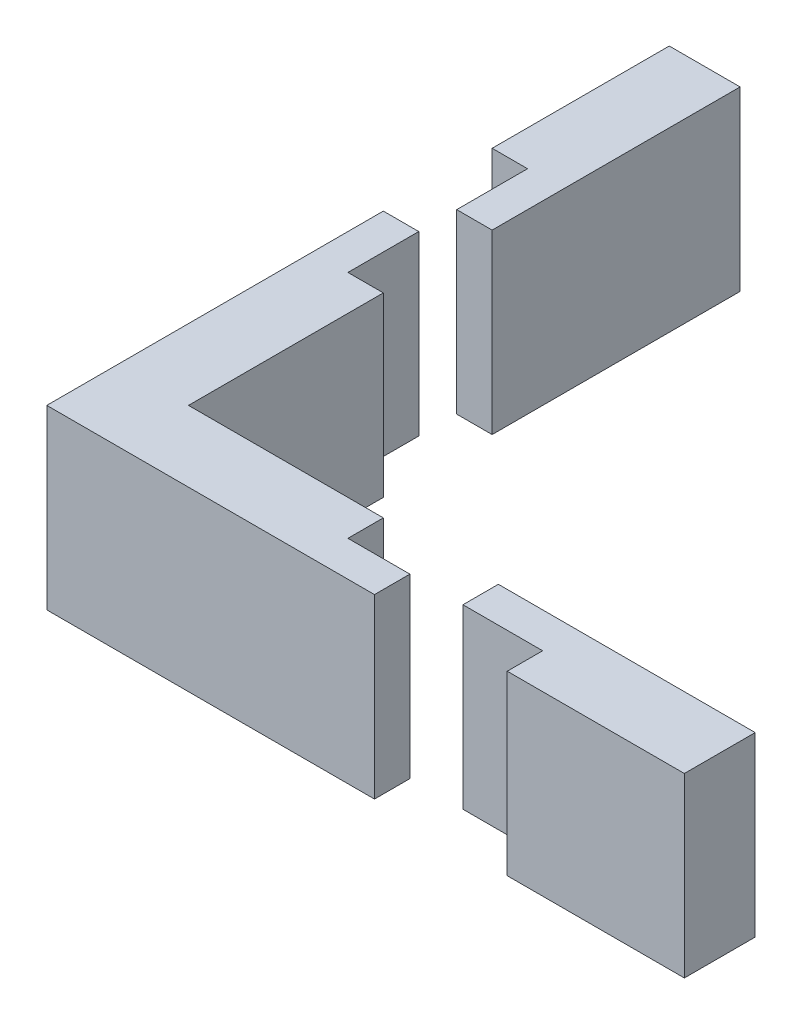
ISO-10303-21;
HEADER;
FILE_DESCRIPTION(('STEP AP214'),'2;1');
FILE_NAME('part.step','',(''),(''),'','','');
FILE_SCHEMA(('AUTOMOTIVE_DESIGN { 1 0 10303 214 1 1 1 1 }'));
ENDSEC;
DATA;
#1=APPLICATION_CONTEXT('core data for automotive mechanical design processes');
#2=APPLICATION_PROTOCOL_DEFINITION('international standard','automotive_design',2000,#1);
#3=PRODUCT_CONTEXT('',#1,'mechanical');
#4=PRODUCT('Part','Part','',(#3));
#5=PRODUCT_RELATED_PRODUCT_CATEGORY('part','',(#4));
#6=PRODUCT_DEFINITION_FORMATION('','',#4);
#7=PRODUCT_DEFINITION_CONTEXT('part definition',#1,'design');
#8=PRODUCT_DEFINITION('design','',#6,#7);
#9=PRODUCT_DEFINITION_SHAPE('','',#8);
#10=(LENGTH_UNIT() NAMED_UNIT(*) SI_UNIT(.MILLI.,.METRE.));
#11=(NAMED_UNIT(*) PLANE_ANGLE_UNIT() SI_UNIT($,.RADIAN.));
#12=(NAMED_UNIT(*) SI_UNIT($,.STERADIAN.) SOLID_ANGLE_UNIT());
#13=UNCERTAINTY_MEASURE_WITH_UNIT(LENGTH_MEASURE(1.E-05),#10,'distance_accuracy_value','');
#14=(GEOMETRIC_REPRESENTATION_CONTEXT(3) GLOBAL_UNCERTAINTY_ASSIGNED_CONTEXT((#13)) GLOBAL_UNIT_ASSIGNED_CONTEXT((#10,
#11,#12)) REPRESENTATION_CONTEXT('',''));
#15=CARTESIAN_POINT('',(0.,0.,0.));
#16=DIRECTION('',(0.,0.,1.));
#17=DIRECTION('',(1.,0.,0.));
#18=AXIS2_PLACEMENT_3D('',#15,#16,#17);
#19=CARTESIAN_POINT('',(0.,10.,5.5));
#20=DIRECTION('',(0.,0.,-1.));
#21=DIRECTION('',(-1.,0.,0.));
#22=AXIS2_PLACEMENT_3D('',#19,#20,#21);
#23=PLANE('',#22);
#24=DIRECTION('',(1.,0.,0.));
#25=VECTOR('',#24,1.);
#26=CARTESIAN_POINT('',(0.,0.,5.5));
#27=LINE('',#26,#25);
#28=CARTESIAN_POINT('',(19.4948605152185,0.,5.5));
#29=VERTEX_POINT('',#28);
#30=CARTESIAN_POINT('',(23.9948605152185,0.,5.5));
#31=VERTEX_POINT('',#30);
#32=EDGE_CURVE('E132',#29,#31,#27,.T.);
#33=ORIENTED_EDGE('',*,*,#32,.T.);
#34=DIRECTION('',(0.,-1.,0.));
#35=VECTOR('',#34,1.);
#36=CARTESIAN_POINT('',(23.9948605152185,10.,5.5));
#37=LINE('',#36,#35);
#38=CARTESIAN_POINT('',(23.9948605152185,10.,5.5));
#39=VERTEX_POINT('',#38);
#40=EDGE_CURVE('E12',#39,#31,#37,.T.);
#41=ORIENTED_EDGE('',*,*,#40,.F.);
#42=DIRECTION('',(1.,0.,0.));
#43=VECTOR('',#42,1.);
#44=CARTESIAN_POINT('',(0.,10.,5.5));
#45=LINE('',#44,#43);
#46=CARTESIAN_POINT('',(19.4948605152185,10.,5.5));
#47=VERTEX_POINT('',#46);
#48=EDGE_CURVE('E97',#47,#39,#45,.T.);
#49=ORIENTED_EDGE('',*,*,#48,.F.);
#50=DIRECTION('',(0.,-1.,0.));
#51=VECTOR('',#50,1.);
#52=CARTESIAN_POINT('',(19.4948605152185,10.,5.5));
#53=LINE('',#52,#51);
#54=EDGE_CURVE('E66',#47,#29,#53,.T.);
#55=ORIENTED_EDGE('',*,*,#54,.T.);
#56=EDGE_LOOP('',(#33,#41,#49,#55));
#57=FACE_BOUND('',#56,.T.);
#58=ADVANCED_FACE('F50',(#57),#23,.F.);
#59=CARTESIAN_POINT('',(23.9948605152185,10.,0.));
#60=DIRECTION('',(-1.,0.,0.));
#61=DIRECTION('',(0.,0.,1.));
#62=AXIS2_PLACEMENT_3D('',#59,#60,#61);
#63=PLANE('',#62);
#64=DIRECTION('',(0.,0.,-1.));
#65=VECTOR('',#64,1.);
#66=CARTESIAN_POINT('',(23.9948605152185,0.,0.));
#67=LINE('',#66,#65);
#68=CARTESIAN_POINT('',(23.9948605152185,0.,7.5));
#69=VERTEX_POINT('',#68);
#70=EDGE_CURVE('E134',#69,#31,#67,.T.);
#71=ORIENTED_EDGE('',*,*,#70,.F.);
#72=DIRECTION('',(0.,-1.,0.));
#73=VECTOR('',#72,1.);
#74=CARTESIAN_POINT('',(23.9948605152185,10.,7.5));
#75=LINE('',#74,#73);
#76=CARTESIAN_POINT('',(23.9948605152185,10.,7.5));
#77=VERTEX_POINT('',#76);
#78=EDGE_CURVE('E58',#77,#69,#75,.T.);
#79=ORIENTED_EDGE('',*,*,#78,.F.);
#80=DIRECTION('',(0.,0.,-1.));
#81=VECTOR('',#80,1.);
#82=CARTESIAN_POINT('',(23.9948605152185,10.,0.));
#83=LINE('',#82,#81);
#84=EDGE_CURVE('E157',#77,#39,#83,.T.);
#85=ORIENTED_EDGE('',*,*,#84,.T.);
#86=ORIENTED_EDGE('',*,*,#40,.T.);
#87=EDGE_LOOP('',(#71,#79,#85,#86));
#88=FACE_BOUND('',#87,.T.);
#89=ADVANCED_FACE('F156',(#88),#63,.T.);
#90=CARTESIAN_POINT('',(0.,10.,7.5));
#91=DIRECTION('',(0.,0.,-1.));
#92=DIRECTION('',(-1.,0.,0.));
#93=AXIS2_PLACEMENT_3D('',#90,#91,#92);
#94=PLANE('',#93);
#95=DIRECTION('',(1.,0.,0.));
#96=VECTOR('',#95,1.);
#97=CARTESIAN_POINT('',(0.,0.,7.5));
#98=LINE('',#97,#96);
#99=CARTESIAN_POINT('',(33.9948605152185,0.,7.5));
#100=VERTEX_POINT('',#99);
#101=EDGE_CURVE('E137',#69,#100,#98,.T.);
#102=ORIENTED_EDGE('',*,*,#101,.T.);
#103=DIRECTION('',(0.,-1.,0.));
#104=VECTOR('',#103,1.);
#105=CARTESIAN_POINT('',(33.9948605152185,10.,7.5));
#106=LINE('',#105,#104);
#107=CARTESIAN_POINT('',(33.9948605152185,10.,7.5));
#108=VERTEX_POINT('',#107);
#109=EDGE_CURVE('E117',#108,#100,#106,.T.);
#110=ORIENTED_EDGE('',*,*,#109,.F.);
#111=DIRECTION('',(1.,0.,0.));
#112=VECTOR('',#111,1.);
#113=CARTESIAN_POINT('',(0.,10.,7.5));
#114=LINE('',#113,#112);
#115=EDGE_CURVE('E123',#77,#108,#114,.T.);
#116=ORIENTED_EDGE('',*,*,#115,.F.);
#117=ORIENTED_EDGE('',*,*,#78,.T.);
#118=EDGE_LOOP('',(#102,#110,#116,#117));
#119=FACE_BOUND('',#118,.T.);
#120=ADVANCED_FACE('F150',(#119),#94,.F.);
#121=CARTESIAN_POINT('',(33.9948605152185,10.,0.));
#122=DIRECTION('',(1.,0.,0.));
#123=DIRECTION('',(0.,0.,-1.));
#124=AXIS2_PLACEMENT_3D('',#121,#122,#123);
#125=PLANE('',#124);
#126=DIRECTION('',(0.,0.,1.));
#127=VECTOR('',#126,1.);
#128=CARTESIAN_POINT('',(33.9948605152185,0.,0.));
#129=LINE('',#128,#127);
#130=CARTESIAN_POINT('',(33.9948605152185,0.,3.5));
#131=VERTEX_POINT('',#130);
#132=EDGE_CURVE('E113',#131,#100,#129,.T.);
#133=ORIENTED_EDGE('',*,*,#132,.F.);
#134=DIRECTION('',(0.,-1.,0.));
#135=VECTOR('',#134,1.);
#136=CARTESIAN_POINT('',(33.9948605152185,10.,3.5));
#137=LINE('',#136,#135);
#138=CARTESIAN_POINT('',(33.9948605152185,10.,3.5));
#139=VERTEX_POINT('',#138);
#140=EDGE_CURVE('E108',#139,#131,#137,.T.);
#141=ORIENTED_EDGE('',*,*,#140,.F.);
#142=DIRECTION('',(0.,0.,1.));
#143=VECTOR('',#142,1.);
#144=CARTESIAN_POINT('',(33.9948605152185,10.,0.));
#145=LINE('',#144,#143);
#146=EDGE_CURVE('E111',#139,#108,#145,.T.);
#147=ORIENTED_EDGE('',*,*,#146,.T.);
#148=ORIENTED_EDGE('',*,*,#109,.T.);
#149=EDGE_LOOP('',(#133,#141,#147,#148));
#150=FACE_BOUND('',#149,.T.);
#151=ADVANCED_FACE('F110',(#150),#125,.T.);
#152=CARTESIAN_POINT('',(0.,10.,3.5));
#153=DIRECTION('',(0.,0.,-1.));
#154=DIRECTION('',(-1.,0.,0.));
#155=AXIS2_PLACEMENT_3D('',#152,#153,#154);
#156=PLANE('',#155);
#157=DIRECTION('',(1.,0.,0.));
#158=VECTOR('',#157,1.);
#159=CARTESIAN_POINT('',(0.,0.,3.5));
#160=LINE('',#159,#158);
#161=CARTESIAN_POINT('',(19.4948605152185,0.,3.5));
#162=VERTEX_POINT('',#161);
#163=EDGE_CURVE('E141',#162,#131,#160,.T.);
#164=ORIENTED_EDGE('',*,*,#163,.F.);
#165=DIRECTION('',(0.,-1.,0.));
#166=VECTOR('',#165,1.);
#167=CARTESIAN_POINT('',(19.4948605152185,10.,3.5));
#168=LINE('',#167,#166);
#169=CARTESIAN_POINT('',(19.4948605152185,10.,3.5));
#170=VERTEX_POINT('',#169);
#171=EDGE_CURVE('E85',#170,#162,#168,.T.);
#172=ORIENTED_EDGE('',*,*,#171,.F.);
#173=DIRECTION('',(1.,0.,0.));
#174=VECTOR('',#173,1.);
#175=CARTESIAN_POINT('',(0.,10.,3.5));
#176=LINE('',#175,#174);
#177=EDGE_CURVE('E121',#170,#139,#176,.T.);
#178=ORIENTED_EDGE('',*,*,#177,.T.);
#179=ORIENTED_EDGE('',*,*,#140,.T.);
#180=EDGE_LOOP('',(#164,#172,#178,#179));
#181=FACE_BOUND('',#180,.T.);
#182=ADVANCED_FACE('F126',(#181),#156,.T.);
#183=CARTESIAN_POINT('',(19.4948605152185,10.,0.));
#184=DIRECTION('',(-1.,0.,0.));
#185=DIRECTION('',(0.,0.,1.));
#186=AXIS2_PLACEMENT_3D('',#183,#184,#185);
#187=PLANE('',#186);
#188=DIRECTION('',(0.,0.,-1.));
#189=VECTOR('',#188,1.);
#190=CARTESIAN_POINT('',(19.4948605152185,0.,0.));
#191=LINE('',#190,#189);
#192=EDGE_CURVE('E143',#29,#162,#191,.T.);
#193=ORIENTED_EDGE('',*,*,#192,.F.);
#194=ORIENTED_EDGE('',*,*,#54,.F.);
#195=DIRECTION('',(0.,0.,-1.));
#196=VECTOR('',#195,1.);
#197=CARTESIAN_POINT('',(19.4948605152185,10.,0.));
#198=LINE('',#197,#196);
#199=EDGE_CURVE('E127',#47,#170,#198,.T.);
#200=ORIENTED_EDGE('',*,*,#199,.T.);
#201=ORIENTED_EDGE('',*,*,#171,.T.);
#202=EDGE_LOOP('',(#193,#194,#200,#201));
#203=FACE_BOUND('',#202,.T.);
#204=ADVANCED_FACE('F158',(#203),#187,.T.);
#205=CARTESIAN_POINT('',(0.,10.,0.));
#206=DIRECTION('',(0.,1.,0.));
#207=DIRECTION('',(0.,0.,1.));
#208=AXIS2_PLACEMENT_3D('',#205,#206,#207);
#209=PLANE('',#208);
#210=ORIENTED_EDGE('',*,*,#48,.T.);
#211=ORIENTED_EDGE('',*,*,#84,.F.);
#212=ORIENTED_EDGE('',*,*,#115,.T.);
#213=ORIENTED_EDGE('',*,*,#146,.F.);
#214=ORIENTED_EDGE('',*,*,#177,.F.);
#215=ORIENTED_EDGE('',*,*,#199,.F.);
#216=EDGE_LOOP('',(#210,#211,#212,#213,#214,#215));
#217=FACE_BOUND('',#216,.T.);
#218=ADVANCED_FACE('F120',(#217),#209,.T.);
#219=CARTESIAN_POINT('',(0.,0.,0.));
#220=DIRECTION('',(0.,1.,0.));
#221=DIRECTION('',(0.,0.,1.));
#222=AXIS2_PLACEMENT_3D('',#219,#220,#221);
#223=PLANE('',#222);
#224=ORIENTED_EDGE('',*,*,#32,.F.);
#225=ORIENTED_EDGE('',*,*,#192,.T.);
#226=ORIENTED_EDGE('',*,*,#163,.T.);
#227=ORIENTED_EDGE('',*,*,#132,.T.);
#228=ORIENTED_EDGE('',*,*,#101,.F.);
#229=ORIENTED_EDGE('',*,*,#70,.T.);
#230=EDGE_LOOP('',(#224,#225,#226,#227,#228,#229));
#231=FACE_BOUND('',#230,.T.);
#232=ADVANCED_FACE('F155',(#231),#223,.F.);
#233=CLOSED_SHELL('',(#58,#89,#120,#151,#182,#204,#218,#232));
#234=MANIFOLD_SOLID_BREP('B2',#233);
#235=CARTESIAN_POINT('',(-2.,10.,0.));
#236=DIRECTION('',(-1.,0.,0.));
#237=DIRECTION('',(0.,0.,1.));
#238=AXIS2_PLACEMENT_3D('',#235,#236,#237);
#239=PLANE('',#238);
#240=DIRECTION('',(0.,0.,-1.));
#241=VECTOR('',#240,1.);
#242=CARTESIAN_POINT('',(-2.,0.,0.));
#243=LINE('',#242,#241);
#244=CARTESIAN_POINT('',(-2.,0.,7.5));
#245=VERTEX_POINT('',#244);
#246=CARTESIAN_POINT('',(-2.,0.,-11.5));
#247=VERTEX_POINT('',#246);
#248=EDGE_CURVE('E355',#245,#247,#243,.T.);
#249=ORIENTED_EDGE('',*,*,#248,.F.);
#250=DIRECTION('',(0.,-1.,0.));
#251=VECTOR('',#250,1.);
#252=CARTESIAN_POINT('',(-2.,10.,7.5));
#253=LINE('',#252,#251);
#254=CARTESIAN_POINT('',(-2.,10.,7.5));
#255=VERTEX_POINT('',#254);
#256=EDGE_CURVE('E48',#255,#245,#253,.T.);
#257=ORIENTED_EDGE('',*,*,#256,.F.);
#258=DIRECTION('',(0.,0.,-1.));
#259=VECTOR('',#258,1.);
#260=CARTESIAN_POINT('',(-2.,10.,0.));
#261=LINE('',#260,#259);
#262=CARTESIAN_POINT('',(-2.,10.,-11.5));
#263=VERTEX_POINT('',#262);
#264=EDGE_CURVE('E380',#255,#263,#261,.T.);
#265=ORIENTED_EDGE('',*,*,#264,.T.);
#266=DIRECTION('',(0.,-1.,0.));
#267=VECTOR('',#266,1.);
#268=CARTESIAN_POINT('',(-2.,10.,-11.5));
#269=LINE('',#268,#267);
#270=EDGE_CURVE('E263',#263,#247,#269,.T.);
#271=ORIENTED_EDGE('',*,*,#270,.T.);
#272=EDGE_LOOP('',(#249,#257,#265,#271));
#273=FACE_BOUND('',#272,.T.);
#274=ADVANCED_FACE('F247',(#273),#239,.T.);
#275=CARTESIAN_POINT('',(0.,10.,7.5));
#276=DIRECTION('',(0.,0.,-1.));
#277=DIRECTION('',(-1.,0.,0.));
#278=AXIS2_PLACEMENT_3D('',#275,#276,#277);
#279=PLANE('',#278);
#280=DIRECTION('',(1.,0.,0.));
#281=VECTOR('',#280,1.);
#282=CARTESIAN_POINT('',(0.,0.,7.5));
#283=LINE('',#282,#281);
#284=CARTESIAN_POINT('',(16.5,0.,7.5));
#285=VERTEX_POINT('',#284);
#286=EDGE_CURVE('E357',#245,#285,#283,.T.);
#287=ORIENTED_EDGE('',*,*,#286,.T.);
#288=DIRECTION('',(0.,-1.,0.));
#289=VECTOR('',#288,1.);
#290=CARTESIAN_POINT('',(16.5,10.,7.5));
#291=LINE('',#290,#289);
#292=CARTESIAN_POINT('',(16.5,10.,7.5));
#293=VERTEX_POINT('',#292);
#294=EDGE_CURVE('E255',#293,#285,#291,.T.);
#295=ORIENTED_EDGE('',*,*,#294,.F.);
#296=DIRECTION('',(1.,0.,0.));
#297=VECTOR('',#296,1.);
#298=CARTESIAN_POINT('',(0.,10.,7.5));
#299=LINE('',#298,#297);
#300=EDGE_CURVE('E414',#255,#293,#299,.T.);
#301=ORIENTED_EDGE('',*,*,#300,.F.);
#302=ORIENTED_EDGE('',*,*,#256,.T.);
#303=EDGE_LOOP('',(#287,#295,#301,#302));
#304=FACE_BOUND('',#303,.T.);
#305=ADVANCED_FACE('F436',(#304),#279,.F.);
#306=CARTESIAN_POINT('',(16.5,10.,0.));
#307=DIRECTION('',(-1.,0.,0.));
#308=DIRECTION('',(0.,0.,1.));
#309=AXIS2_PLACEMENT_3D('',#306,#307,#308);
#310=PLANE('',#309);
#311=DIRECTION('',(0.,0.,-1.));
#312=VECTOR('',#311,1.);
#313=CARTESIAN_POINT('',(16.5,0.,0.));
#314=LINE('',#313,#312);
#315=CARTESIAN_POINT('',(16.5,0.,5.5));
#316=VERTEX_POINT('',#315);
#317=EDGE_CURVE('E359',#285,#316,#314,.T.);
#318=ORIENTED_EDGE('',*,*,#317,.T.);
#319=DIRECTION('',(0.,-1.,0.));
#320=VECTOR('',#319,1.);
#321=CARTESIAN_POINT('',(16.5,10.,5.5));
#322=LINE('',#321,#320);
#323=CARTESIAN_POINT('',(16.5,10.,5.5));
#324=VERTEX_POINT('',#323);
#325=EDGE_CURVE('E390',#324,#316,#322,.T.);
#326=ORIENTED_EDGE('',*,*,#325,.F.);
#327=DIRECTION('',(0.,0.,-1.));
#328=VECTOR('',#327,1.);
#329=CARTESIAN_POINT('',(16.5,10.,0.));
#330=LINE('',#329,#328);
#331=EDGE_CURVE('E398',#293,#324,#330,.T.);
#332=ORIENTED_EDGE('',*,*,#331,.F.);
#333=ORIENTED_EDGE('',*,*,#294,.T.);
#334=EDGE_LOOP('',(#318,#326,#332,#333));
#335=FACE_BOUND('',#334,.T.);
#336=ADVANCED_FACE('F396',(#335),#310,.F.);
#337=CARTESIAN_POINT('',(0.,10.,5.5));
#338=DIRECTION('',(0.,0.,-1.));
#339=DIRECTION('',(-1.,0.,0.));
#340=AXIS2_PLACEMENT_3D('',#337,#338,#339);
#341=PLANE('',#340);
#342=DIRECTION('',(1.,0.,0.));
#343=VECTOR('',#342,1.);
#344=CARTESIAN_POINT('',(0.,0.,5.5));
#345=LINE('',#344,#343);
#346=CARTESIAN_POINT('',(13.,0.,5.5));
#347=VERTEX_POINT('',#346);
#348=EDGE_CURVE('E362',#347,#316,#345,.T.);
#349=ORIENTED_EDGE('',*,*,#348,.F.);
#350=DIRECTION('',(0.,-1.,0.));
#351=VECTOR('',#350,1.);
#352=CARTESIAN_POINT('',(13.,10.,5.5));
#353=LINE('',#352,#351);
#354=CARTESIAN_POINT('',(13.,10.,5.5));
#355=VERTEX_POINT('',#354);
#356=EDGE_CURVE('E388',#355,#347,#353,.T.);
#357=ORIENTED_EDGE('',*,*,#356,.F.);
#358=DIRECTION('',(1.,0.,0.));
#359=VECTOR('',#358,1.);
#360=CARTESIAN_POINT('',(0.,10.,5.5));
#361=LINE('',#360,#359);
#362=EDGE_CURVE('E410',#355,#324,#361,.T.);
#363=ORIENTED_EDGE('',*,*,#362,.T.);
#364=ORIENTED_EDGE('',*,*,#325,.T.);
#365=EDGE_LOOP('',(#349,#357,#363,#364));
#366=FACE_BOUND('',#365,.T.);
#367=ADVANCED_FACE('F406',(#366),#341,.T.);
#368=CARTESIAN_POINT('',(13.,10.,0.));
#369=DIRECTION('',(-1.,0.,0.));
#370=DIRECTION('',(0.,0.,1.));
#371=AXIS2_PLACEMENT_3D('',#368,#369,#370);
#372=PLANE('',#371);
#373=DIRECTION('',(0.,0.,-1.));
#374=VECTOR('',#373,1.);
#375=CARTESIAN_POINT('',(13.,0.,0.));
#376=LINE('',#375,#374);
#377=CARTESIAN_POINT('',(13.,0.,3.5));
#378=VERTEX_POINT('',#377);
#379=EDGE_CURVE('E365',#347,#378,#376,.T.);
#380=ORIENTED_EDGE('',*,*,#379,.T.);
#381=DIRECTION('',(0.,-1.,0.));
#382=VECTOR('',#381,1.);
#383=CARTESIAN_POINT('',(13.,10.,3.5));
#384=LINE('',#383,#382);
#385=CARTESIAN_POINT('',(13.,10.,3.5));
#386=VERTEX_POINT('',#385);
#387=EDGE_CURVE('E386',#386,#378,#384,.T.);
#388=ORIENTED_EDGE('',*,*,#387,.F.);
#389=DIRECTION('',(0.,0.,-1.));
#390=VECTOR('',#389,1.);
#391=CARTESIAN_POINT('',(13.,10.,0.));
#392=LINE('',#391,#390);
#393=EDGE_CURVE('E411',#355,#386,#392,.T.);
#394=ORIENTED_EDGE('',*,*,#393,.F.);
#395=ORIENTED_EDGE('',*,*,#356,.T.);
#396=EDGE_LOOP('',(#380,#388,#394,#395));
#397=FACE_BOUND('',#396,.T.);
#398=ADVANCED_FACE('F447',(#397),#372,.F.);
#399=CARTESIAN_POINT('',(0.,10.,3.5));
#400=DIRECTION('',(0.,0.,-1.));
#401=DIRECTION('',(-1.,0.,0.));
#402=AXIS2_PLACEMENT_3D('',#399,#400,#401);
#403=PLANE('',#402);
#404=DIRECTION('',(1.,0.,0.));
#405=VECTOR('',#404,1.);
#406=CARTESIAN_POINT('',(0.,0.,3.5));
#407=LINE('',#406,#405);
#408=CARTESIAN_POINT('',(2.,0.,3.5));
#409=VERTEX_POINT('',#408);
#410=EDGE_CURVE('E368',#409,#378,#407,.T.);
#411=ORIENTED_EDGE('',*,*,#410,.F.);
#412=DIRECTION('',(0.,-1.,0.));
#413=VECTOR('',#412,1.);
#414=CARTESIAN_POINT('',(2.,10.,3.5));
#415=LINE('',#414,#413);
#416=CARTESIAN_POINT('',(2.,10.,3.5));
#417=VERTEX_POINT('',#416);
#418=EDGE_CURVE('E384',#417,#409,#415,.T.);
#419=ORIENTED_EDGE('',*,*,#418,.F.);
#420=DIRECTION('',(1.,0.,0.));
#421=VECTOR('',#420,1.);
#422=CARTESIAN_POINT('',(0.,10.,3.5));
#423=LINE('',#422,#421);
#424=EDGE_CURVE('E350',#417,#386,#423,.T.);
#425=ORIENTED_EDGE('',*,*,#424,.T.);
#426=ORIENTED_EDGE('',*,*,#387,.T.);
#427=EDGE_LOOP('',(#411,#419,#425,#426));
#428=FACE_BOUND('',#427,.T.);
#429=ADVANCED_FACE('F420',(#428),#403,.T.);
#430=CARTESIAN_POINT('',(2.,10.,0.));
#431=DIRECTION('',(1.,0.,0.));
#432=DIRECTION('',(0.,0.,-1.));
#433=AXIS2_PLACEMENT_3D('',#430,#431,#432);
#434=PLANE('',#433);
#435=DIRECTION('',(0.,0.,1.));
#436=VECTOR('',#435,1.);
#437=CARTESIAN_POINT('',(2.,0.,0.));
#438=LINE('',#437,#436);
#439=CARTESIAN_POINT('',(2.,0.,-7.5));
#440=VERTEX_POINT('',#439);
#441=EDGE_CURVE('E371',#440,#409,#438,.T.);
#442=ORIENTED_EDGE('',*,*,#441,.F.);
#443=DIRECTION('',(0.,-1.,0.));
#444=VECTOR('',#443,1.);
#445=CARTESIAN_POINT('',(2.,10.,-7.5));
#446=LINE('',#445,#444);
#447=CARTESIAN_POINT('',(2.,10.,-7.5));
#448=VERTEX_POINT('',#447);
#449=EDGE_CURVE('E335',#448,#440,#446,.T.);
#450=ORIENTED_EDGE('',*,*,#449,.F.);
#451=DIRECTION('',(0.,0.,1.));
#452=VECTOR('',#451,1.);
#453=CARTESIAN_POINT('',(2.,10.,0.));
#454=LINE('',#453,#452);
#455=EDGE_CURVE('E348',#448,#417,#454,.T.);
#456=ORIENTED_EDGE('',*,*,#455,.T.);
#457=ORIENTED_EDGE('',*,*,#418,.T.);
#458=EDGE_LOOP('',(#442,#450,#456,#457));
#459=FACE_BOUND('',#458,.T.);
#460=ADVANCED_FACE('F424',(#459),#434,.T.);
#461=CARTESIAN_POINT('',(0.,10.,-7.5));
#462=DIRECTION('',(0.,0.,-1.));
#463=DIRECTION('',(-1.,0.,0.));
#464=AXIS2_PLACEMENT_3D('',#461,#462,#463);
#465=PLANE('',#464);
#466=DIRECTION('',(1.,0.,0.));
#467=VECTOR('',#466,1.);
#468=CARTESIAN_POINT('',(0.,0.,-7.5));
#469=LINE('',#468,#467);
#470=CARTESIAN_POINT('',(0.,0.,-7.5));
#471=VERTEX_POINT('',#470);
#472=EDGE_CURVE('E332',#471,#440,#469,.T.);
#473=ORIENTED_EDGE('',*,*,#472,.F.);
#474=DIRECTION('',(0.,-1.,0.));
#475=VECTOR('',#474,1.);
#476=CARTESIAN_POINT('',(0.,10.,-7.5));
#477=LINE('',#476,#475);
#478=CARTESIAN_POINT('',(0.,10.,-7.5));
#479=VERTEX_POINT('',#478);
#480=EDGE_CURVE('E326',#479,#471,#477,.T.);
#481=ORIENTED_EDGE('',*,*,#480,.F.);
#482=DIRECTION('',(1.,0.,0.));
#483=VECTOR('',#482,1.);
#484=CARTESIAN_POINT('',(0.,10.,-7.5));
#485=LINE('',#484,#483);
#486=EDGE_CURVE('E330',#479,#448,#485,.T.);
#487=ORIENTED_EDGE('',*,*,#486,.T.);
#488=ORIENTED_EDGE('',*,*,#449,.T.);
#489=EDGE_LOOP('',(#473,#481,#487,#488));
#490=FACE_BOUND('',#489,.T.);
#491=ADVANCED_FACE('F328',(#490),#465,.T.);
#492=CARTESIAN_POINT('',(0.,10.,0.));
#493=DIRECTION('',(-1.,0.,0.));
#494=DIRECTION('',(0.,0.,1.));
#495=AXIS2_PLACEMENT_3D('',#492,#493,#494);
#496=PLANE('',#495);
#497=DIRECTION('',(0.,0.,-1.));
#498=VECTOR('',#497,1.);
#499=CARTESIAN_POINT('',(0.,0.,0.));
#500=LINE('',#499,#498);
#501=CARTESIAN_POINT('',(0.,0.,-11.5));
#502=VERTEX_POINT('',#501);
#503=EDGE_CURVE('E375',#471,#502,#500,.T.);
#504=ORIENTED_EDGE('',*,*,#503,.T.);
#505=DIRECTION('',(0.,-1.,0.));
#506=VECTOR('',#505,1.);
#507=CARTESIAN_POINT('',(0.,10.,-11.5));
#508=LINE('',#507,#506);
#509=CARTESIAN_POINT('',(0.,10.,-11.5));
#510=VERTEX_POINT('',#509);
#511=EDGE_CURVE('E295',#510,#502,#508,.T.);
#512=ORIENTED_EDGE('',*,*,#511,.F.);
#513=DIRECTION('',(0.,0.,-1.));
#514=VECTOR('',#513,1.);
#515=CARTESIAN_POINT('',(0.,10.,0.));
#516=LINE('',#515,#514);
#517=EDGE_CURVE('E337',#479,#510,#516,.T.);
#518=ORIENTED_EDGE('',*,*,#517,.F.);
#519=ORIENTED_EDGE('',*,*,#480,.T.);
#520=EDGE_LOOP('',(#504,#512,#518,#519));
#521=FACE_BOUND('',#520,.T.);
#522=ADVANCED_FACE('F338',(#521),#496,.F.);
#523=CARTESIAN_POINT('',(0.,10.,-11.5));
#524=DIRECTION('',(0.,0.,-1.));
#525=DIRECTION('',(-1.,0.,0.));
#526=AXIS2_PLACEMENT_3D('',#523,#524,#525);
#527=PLANE('',#526);
#528=DIRECTION('',(1.,0.,0.));
#529=VECTOR('',#528,1.);
#530=CARTESIAN_POINT('',(0.,0.,-11.5));
#531=LINE('',#530,#529);
#532=EDGE_CURVE('E377',#247,#502,#531,.T.);
#533=ORIENTED_EDGE('',*,*,#532,.F.);
#534=ORIENTED_EDGE('',*,*,#270,.F.);
#535=DIRECTION('',(1.,0.,0.));
#536=VECTOR('',#535,1.);
#537=CARTESIAN_POINT('',(0.,10.,-11.5));
#538=LINE('',#537,#536);
#539=EDGE_CURVE('E341',#263,#510,#538,.T.);
#540=ORIENTED_EDGE('',*,*,#539,.T.);
#541=ORIENTED_EDGE('',*,*,#511,.T.);
#542=EDGE_LOOP('',(#533,#534,#540,#541));
#543=FACE_BOUND('',#542,.T.);
#544=ADVANCED_FACE('F425',(#543),#527,.T.);
#545=CARTESIAN_POINT('',(0.,10.,0.));
#546=DIRECTION('',(0.,1.,0.));
#547=DIRECTION('',(0.,0.,1.));
#548=AXIS2_PLACEMENT_3D('',#545,#546,#547);
#549=PLANE('',#548);
#550=ORIENTED_EDGE('',*,*,#264,.F.);
#551=ORIENTED_EDGE('',*,*,#300,.T.);
#552=ORIENTED_EDGE('',*,*,#331,.T.);
#553=ORIENTED_EDGE('',*,*,#362,.F.);
#554=ORIENTED_EDGE('',*,*,#393,.T.);
#555=ORIENTED_EDGE('',*,*,#424,.F.);
#556=ORIENTED_EDGE('',*,*,#455,.F.);
#557=ORIENTED_EDGE('',*,*,#486,.F.);
#558=ORIENTED_EDGE('',*,*,#517,.T.);
#559=ORIENTED_EDGE('',*,*,#539,.F.);
#560=EDGE_LOOP('',(#550,#551,#552,#553,#554,#555,#556,#557,#558,#559));
#561=FACE_BOUND('',#560,.T.);
#562=ADVANCED_FACE('F345',(#561),#549,.T.);
#563=CARTESIAN_POINT('',(0.,0.,0.));
#564=DIRECTION('',(0.,1.,0.));
#565=DIRECTION('',(0.,0.,1.));
#566=AXIS2_PLACEMENT_3D('',#563,#564,#565);
#567=PLANE('',#566);
#568=ORIENTED_EDGE('',*,*,#248,.T.);
#569=ORIENTED_EDGE('',*,*,#532,.T.);
#570=ORIENTED_EDGE('',*,*,#503,.F.);
#571=ORIENTED_EDGE('',*,*,#472,.T.);
#572=ORIENTED_EDGE('',*,*,#441,.T.);
#573=ORIENTED_EDGE('',*,*,#410,.T.);
#574=ORIENTED_EDGE('',*,*,#379,.F.);
#575=ORIENTED_EDGE('',*,*,#348,.T.);
#576=ORIENTED_EDGE('',*,*,#317,.F.);
#577=ORIENTED_EDGE('',*,*,#286,.F.);
#578=EDGE_LOOP('',(#568,#569,#570,#571,#572,#573,#574,#575,#576,#577));
#579=FACE_BOUND('',#578,.T.);
#580=ADVANCED_FACE('F402',(#579),#567,.F.);
#581=CLOSED_SHELL('',(#274,#305,#336,#367,#398,#429,#460,#491,#522,#544,#562,#580));
#582=MANIFOLD_SOLID_BREP('B6',#581);
#583=CARTESIAN_POINT('',(-2.,10.,0.));
#584=DIRECTION('',(-1.,0.,0.));
#585=DIRECTION('',(0.,0.,1.));
#586=AXIS2_PLACEMENT_3D('',#583,#584,#585);
#587=PLANE('',#586);
#588=DIRECTION('',(0.,0.,-1.));
#589=VECTOR('',#588,1.);
#590=CARTESIAN_POINT('',(-2.,0.,0.));
#591=LINE('',#590,#589);
#592=CARTESIAN_POINT('',(-2.,0.,-17.6424504485413));
#593=VERTEX_POINT('',#592);
#594=CARTESIAN_POINT('',(-2.,0.,-27.6424504485413));
#595=VERTEX_POINT('',#594);
#596=EDGE_CURVE('E643',#593,#595,#591,.T.);
#597=ORIENTED_EDGE('',*,*,#596,.F.);
#598=DIRECTION('',(0.,-1.,0.));
#599=VECTOR('',#598,1.);
#600=CARTESIAN_POINT('',(-2.,10.,-17.6424504485413));
#601=LINE('',#600,#599);
#602=CARTESIAN_POINT('',(-2.,10.,-17.6424504485413));
#603=VERTEX_POINT('',#602);
#604=EDGE_CURVE('E245',#603,#593,#601,.T.);
#605=ORIENTED_EDGE('',*,*,#604,.F.);
#606=DIRECTION('',(0.,0.,-1.));
#607=VECTOR('',#606,1.);
#608=CARTESIAN_POINT('',(-2.,10.,0.));
#609=LINE('',#608,#607);
#610=CARTESIAN_POINT('',(-2.,10.,-27.6424504485413));
#611=VERTEX_POINT('',#610);
#612=EDGE_CURVE('E656',#603,#611,#609,.T.);
#613=ORIENTED_EDGE('',*,*,#612,.T.);
#614=DIRECTION('',(0.,-1.,0.));
#615=VECTOR('',#614,1.);
#616=CARTESIAN_POINT('',(-2.,10.,-27.6424504485413));
#617=LINE('',#616,#615);
#618=EDGE_CURVE('E608',#611,#595,#617,.T.);
#619=ORIENTED_EDGE('',*,*,#618,.T.);
#620=EDGE_LOOP('',(#597,#605,#613,#619));
#621=FACE_BOUND('',#620,.T.);
#622=ADVANCED_FACE('F563',(#621),#587,.T.);
#623=CARTESIAN_POINT('',(0.,10.,-17.6424504485413));
#624=DIRECTION('',(0.,0.,1.));
#625=DIRECTION('',(1.,0.,0.));
#626=AXIS2_PLACEMENT_3D('',#623,#624,#625);
#627=PLANE('',#626);
#628=DIRECTION('',(-1.,0.,0.));
#629=VECTOR('',#628,1.);
#630=CARTESIAN_POINT('',(0.,0.,-17.6424504485413));
#631=LINE('',#630,#629);
#632=CARTESIAN_POINT('',(0.,0.,-17.6424504485413));
#633=VERTEX_POINT('',#632);
#634=EDGE_CURVE('E646',#633,#593,#631,.T.);
#635=ORIENTED_EDGE('',*,*,#634,.F.);
#636=DIRECTION('',(0.,-1.,0.));
#637=VECTOR('',#636,1.);
#638=CARTESIAN_POINT('',(0.,10.,-17.6424504485413));
#639=LINE('',#638,#637);
#640=CARTESIAN_POINT('',(0.,10.,-17.6424504485413));
#641=VERTEX_POINT('',#640);
#642=EDGE_CURVE('E571',#641,#633,#639,.T.);
#643=ORIENTED_EDGE('',*,*,#642,.F.);
#644=DIRECTION('',(-1.,0.,0.));
#645=VECTOR('',#644,1.);
#646=CARTESIAN_POINT('',(0.,10.,-17.6424504485413));
#647=LINE('',#646,#645);
#648=EDGE_CURVE('E671',#641,#603,#647,.T.);
#649=ORIENTED_EDGE('',*,*,#648,.T.);
#650=ORIENTED_EDGE('',*,*,#604,.T.);
#651=EDGE_LOOP('',(#635,#643,#649,#650));
#652=FACE_BOUND('',#651,.T.);
#653=ADVANCED_FACE('F665',(#652),#627,.T.);
#654=CARTESIAN_POINT('',(0.,10.,0.));
#655=DIRECTION('',(-1.,0.,0.));
#656=DIRECTION('',(0.,0.,1.));
#657=AXIS2_PLACEMENT_3D('',#654,#655,#656);
#658=PLANE('',#657);
#659=DIRECTION('',(0.,0.,-1.));
#660=VECTOR('',#659,1.);
#661=CARTESIAN_POINT('',(0.,0.,0.));
#662=LINE('',#661,#660);
#663=CARTESIAN_POINT('',(0.,0.,-13.6424504485413));
#664=VERTEX_POINT('',#663);
#665=EDGE_CURVE('E649',#664,#633,#662,.T.);
#666=ORIENTED_EDGE('',*,*,#665,.F.);
#667=DIRECTION('',(0.,-1.,0.));
#668=VECTOR('',#667,1.);
#669=CARTESIAN_POINT('',(0.,10.,-13.6424504485413));
#670=LINE('',#669,#668);
#671=CARTESIAN_POINT('',(0.,10.,-13.6424504485413));
#672=VERTEX_POINT('',#671);
#673=EDGE_CURVE('E635',#672,#664,#670,.T.);
#674=ORIENTED_EDGE('',*,*,#673,.F.);
#675=DIRECTION('',(0.,0.,-1.));
#676=VECTOR('',#675,1.);
#677=CARTESIAN_POINT('',(0.,10.,0.));
#678=LINE('',#677,#676);
#679=EDGE_CURVE('E628',#672,#641,#678,.T.);
#680=ORIENTED_EDGE('',*,*,#679,.T.);
#681=ORIENTED_EDGE('',*,*,#642,.T.);
#682=EDGE_LOOP('',(#666,#674,#680,#681));
#683=FACE_BOUND('',#682,.T.);
#684=ADVANCED_FACE('F662',(#683),#658,.T.);
#685=CARTESIAN_POINT('',(0.,10.,-13.6424504485413));
#686=DIRECTION('',(0.,0.,-1.));
#687=DIRECTION('',(-1.,0.,0.));
#688=AXIS2_PLACEMENT_3D('',#685,#686,#687);
#689=PLANE('',#688);
#690=DIRECTION('',(1.,0.,0.));
#691=VECTOR('',#690,1.);
#692=CARTESIAN_POINT('',(0.,0.,-13.6424504485413));
#693=LINE('',#692,#691);
#694=CARTESIAN_POINT('',(2.,0.,-13.6424504485413));
#695=VERTEX_POINT('',#694);
#696=EDGE_CURVE('E634',#664,#695,#693,.T.);
#697=ORIENTED_EDGE('',*,*,#696,.T.);
#698=DIRECTION('',(0.,-1.,0.));
#699=VECTOR('',#698,1.);
#700=CARTESIAN_POINT('',(2.,10.,-13.6424504485413));
#701=LINE('',#700,#699);
#702=CARTESIAN_POINT('',(2.,10.,-13.6424504485413));
#703=VERTEX_POINT('',#702);
#704=EDGE_CURVE('E631',#703,#695,#701,.T.);
#705=ORIENTED_EDGE('',*,*,#704,.F.);
#706=DIRECTION('',(1.,0.,0.));
#707=VECTOR('',#706,1.);
#708=CARTESIAN_POINT('',(0.,10.,-13.6424504485413));
#709=LINE('',#708,#707);
#710=EDGE_CURVE('E621',#672,#703,#709,.T.);
#711=ORIENTED_EDGE('',*,*,#710,.F.);
#712=ORIENTED_EDGE('',*,*,#673,.T.);
#713=EDGE_LOOP('',(#697,#705,#711,#712));
#714=FACE_BOUND('',#713,.T.);
#715=ADVANCED_FACE('F632',(#714),#689,.F.);
#716=CARTESIAN_POINT('',(2.,10.,0.));
#717=DIRECTION('',(-1.,0.,0.));
#718=DIRECTION('',(0.,0.,1.));
#719=AXIS2_PLACEMENT_3D('',#716,#717,#718);
#720=PLANE('',#719);
#721=DIRECTION('',(0.,0.,-1.));
#722=VECTOR('',#721,1.);
#723=CARTESIAN_POINT('',(2.,0.,0.));
#724=LINE('',#723,#722);
#725=CARTESIAN_POINT('',(2.,0.,-27.6424504485413));
#726=VERTEX_POINT('',#725);
#727=EDGE_CURVE('E601',#695,#726,#724,.T.);
#728=ORIENTED_EDGE('',*,*,#727,.T.);
#729=DIRECTION('',(0.,-1.,0.));
#730=VECTOR('',#729,1.);
#731=CARTESIAN_POINT('',(2.,10.,-27.6424504485413));
#732=LINE('',#731,#730);
#733=CARTESIAN_POINT('',(2.,10.,-27.6424504485413));
#734=VERTEX_POINT('',#733);
#735=EDGE_CURVE('E636',#734,#726,#732,.T.);
#736=ORIENTED_EDGE('',*,*,#735,.F.);
#737=DIRECTION('',(0.,0.,-1.));
#738=VECTOR('',#737,1.);
#739=CARTESIAN_POINT('',(2.,10.,0.));
#740=LINE('',#739,#738);
#741=EDGE_CURVE('E625',#703,#734,#740,.T.);
#742=ORIENTED_EDGE('',*,*,#741,.F.);
#743=ORIENTED_EDGE('',*,*,#704,.T.);
#744=EDGE_LOOP('',(#728,#736,#742,#743));
#745=FACE_BOUND('',#744,.T.);
#746=ADVANCED_FACE('F638',(#745),#720,.F.);
#747=CARTESIAN_POINT('',(0.,10.,-27.6424504485413));
#748=DIRECTION('',(0.,0.,1.));
#749=DIRECTION('',(1.,0.,0.));
#750=AXIS2_PLACEMENT_3D('',#747,#748,#749);
#751=PLANE('',#750);
#752=DIRECTION('',(-1.,0.,0.));
#753=VECTOR('',#752,1.);
#754=CARTESIAN_POINT('',(0.,0.,-27.6424504485413));
#755=LINE('',#754,#753);
#756=EDGE_CURVE('E654',#726,#595,#755,.T.);
#757=ORIENTED_EDGE('',*,*,#756,.T.);
#758=ORIENTED_EDGE('',*,*,#618,.F.);
#759=DIRECTION('',(-1.,0.,0.));
#760=VECTOR('',#759,1.);
#761=CARTESIAN_POINT('',(0.,10.,-27.6424504485413));
#762=LINE('',#761,#760);
#763=EDGE_CURVE('E579',#734,#611,#762,.T.);
#764=ORIENTED_EDGE('',*,*,#763,.F.);
#765=ORIENTED_EDGE('',*,*,#735,.T.);
#766=EDGE_LOOP('',(#757,#758,#764,#765));
#767=FACE_BOUND('',#766,.T.);
#768=ADVANCED_FACE('F670',(#767),#751,.F.);
#769=CARTESIAN_POINT('',(0.,10.,0.));
#770=DIRECTION('',(0.,1.,0.));
#771=DIRECTION('',(0.,0.,1.));
#772=AXIS2_PLACEMENT_3D('',#769,#770,#771);
#773=PLANE('',#772);
#774=ORIENTED_EDGE('',*,*,#612,.F.);
#775=ORIENTED_EDGE('',*,*,#648,.F.);
#776=ORIENTED_EDGE('',*,*,#679,.F.);
#777=ORIENTED_EDGE('',*,*,#710,.T.);
#778=ORIENTED_EDGE('',*,*,#741,.T.);
#779=ORIENTED_EDGE('',*,*,#763,.T.);
#780=EDGE_LOOP('',(#774,#775,#776,#777,#778,#779));
#781=FACE_BOUND('',#780,.T.);
#782=ADVANCED_FACE('F623',(#781),#773,.T.);
#783=CARTESIAN_POINT('',(0.,0.,0.));
#784=DIRECTION('',(0.,1.,0.));
#785=DIRECTION('',(0.,0.,1.));
#786=AXIS2_PLACEMENT_3D('',#783,#784,#785);
#787=PLANE('',#786);
#788=ORIENTED_EDGE('',*,*,#596,.T.);
#789=ORIENTED_EDGE('',*,*,#756,.F.);
#790=ORIENTED_EDGE('',*,*,#727,.F.);
#791=ORIENTED_EDGE('',*,*,#696,.F.);
#792=ORIENTED_EDGE('',*,*,#665,.T.);
#793=ORIENTED_EDGE('',*,*,#634,.T.);
#794=EDGE_LOOP('',(#788,#789,#790,#791,#792,#793));
#795=FACE_BOUND('',#794,.T.);
#796=ADVANCED_FACE('F667',(#795),#787,.F.);
#797=CLOSED_SHELL('',(#622,#653,#684,#715,#746,#768,#782,#796));
#798=MANIFOLD_SOLID_BREP('B42',#797);
#799=ADVANCED_BREP_SHAPE_REPRESENTATION('',(#18,#234,#582,#798),#14);
#800=SHAPE_DEFINITION_REPRESENTATION(#9,#799);
ENDSEC;
END-ISO-10303-21;
